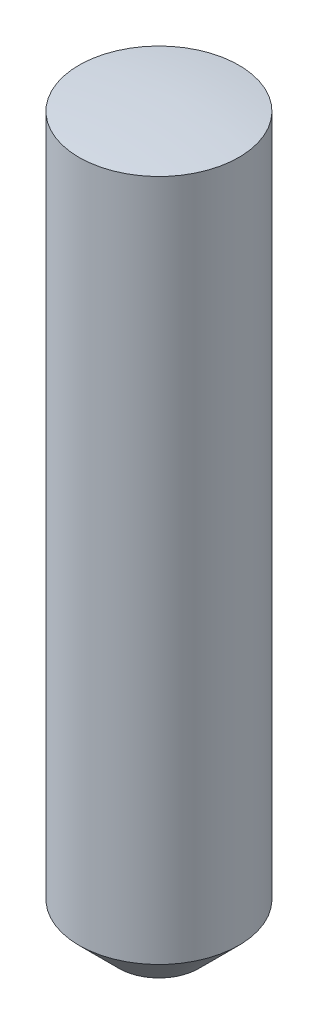
ISO-10303-21;
HEADER;
FILE_DESCRIPTION(('STEP AP214'),'2;1');
FILE_NAME('part.step','',(''),(''),'','','');
FILE_SCHEMA(('AUTOMOTIVE_DESIGN { 1 0 10303 214 1 1 1 1 }'));
ENDSEC;
DATA;
#1=APPLICATION_CONTEXT('core data for automotive mechanical design processes');
#2=APPLICATION_PROTOCOL_DEFINITION('international standard','automotive_design',2000,#1);
#3=PRODUCT_CONTEXT('',#1,'mechanical');
#4=PRODUCT('Part','Part','',(#3));
#5=PRODUCT_RELATED_PRODUCT_CATEGORY('part','',(#4));
#6=PRODUCT_DEFINITION_FORMATION('','',#4);
#7=PRODUCT_DEFINITION_CONTEXT('part definition',#1,'design');
#8=PRODUCT_DEFINITION('design','',#6,#7);
#9=PRODUCT_DEFINITION_SHAPE('','',#8);
#10=(LENGTH_UNIT() NAMED_UNIT(*) SI_UNIT(.MILLI.,.METRE.));
#11=(NAMED_UNIT(*) PLANE_ANGLE_UNIT() SI_UNIT($,.RADIAN.));
#12=(NAMED_UNIT(*) SI_UNIT($,.STERADIAN.) SOLID_ANGLE_UNIT());
#13=UNCERTAINTY_MEASURE_WITH_UNIT(LENGTH_MEASURE(1.E-05),#10,'distance_accuracy_value','');
#14=(GEOMETRIC_REPRESENTATION_CONTEXT(3) GLOBAL_UNCERTAINTY_ASSIGNED_CONTEXT((#13)) GLOBAL_UNIT_ASSIGNED_CONTEXT((#10,
#11,#12)) REPRESENTATION_CONTEXT('',''));
#15=CARTESIAN_POINT('',(0.,0.,0.));
#16=DIRECTION('',(0.,0.,1.));
#17=DIRECTION('',(1.,0.,0.));
#18=AXIS2_PLACEMENT_3D('',#15,#16,#17);
#19=CARTESIAN_POINT('',(0.,-9.1,0.));
#20=DIRECTION('',(0.,1.,0.));
#21=DIRECTION('',(0.,0.,1.));
#22=AXIS2_PLACEMENT_3D('',#19,#20,#21);
#23=PLANE('',#22);
#24=CARTESIAN_POINT('',(0.,-9.09999999993261,0.));
#25=DIRECTION('',(0.,1.,0.));
#26=DIRECTION('',(0.,0.,1.));
#27=AXIS2_PLACEMENT_3D('',#24,#25,#26);
#28=CIRCLE('',#27,0.499999999988177);
#29=CARTESIAN_POINT('',(0.,-9.09999999993261,0.499999999988177));
#30=VERTEX_POINT('',#29);
#31=EDGE_CURVE('E18',#30,#30,#28,.T.);
#32=ORIENTED_EDGE('',*,*,#31,.F.);
#33=EDGE_LOOP('',(#32));
#34=FACE_BOUND('',#33,.T.);
#35=ADVANCED_FACE('F15',(#34),#23,.F.);
#36=CARTESIAN_POINT('',(0.,-8.60000000000127,0.));
#37=DIRECTION('',(0.,1.,0.));
#38=DIRECTION('',(0.,0.,1.));
#39=AXIS2_PLACEMENT_3D('',#36,#37,#38);
#40=CONICAL_SURFACE('',#39,0.99999999991951,0.785398163397448);
#41=CARTESIAN_POINT('',(0.,-8.6,0.));
#42=DIRECTION('',(0.,1.,0.));
#43=DIRECTION('',(0.,0.,1.));
#44=AXIS2_PLACEMENT_3D('',#41,#42,#43);
#45=CIRCLE('',#44,1.);
#46=CARTESIAN_POINT('',(0.,-8.6,1.));
#47=VERTEX_POINT('',#46);
#48=EDGE_CURVE('E22',#47,#47,#45,.T.);
#49=ORIENTED_EDGE('',*,*,#48,.F.);
#50=EDGE_LOOP('',(#49));
#51=FACE_BOUND('',#50,.T.);
#52=ORIENTED_EDGE('',*,*,#31,.T.);
#53=EDGE_LOOP('',(#52));
#54=FACE_BOUND('',#53,.T.);
#55=ADVANCED_FACE('F34',(#51,#54),#40,.T.);
#56=CARTESIAN_POINT('',(0.,-8.,0.));
#57=DIRECTION('',(-1.,0.,0.));
#58=DIRECTION('',(0.,1.,0.));
#59=AXIS2_PLACEMENT_3D('',#56,#57,#58);
#60=SPHERICAL_SURFACE('',#59,8.);
#61=CARTESIAN_POINT('',(0.,-0.0627460668062279,0.));
#62=DIRECTION('',(0.,1.,0.));
#63=DIRECTION('',(0.,0.,1.));
#64=AXIS2_PLACEMENT_3D('',#61,#62,#63);
#65=CIRCLE('',#64,1.);
#66=CARTESIAN_POINT('',(0.,-0.0627460668062279,1.));
#67=VERTEX_POINT('',#66);
#68=EDGE_CURVE('E10',#67,#67,#65,.F.);
#69=ORIENTED_EDGE('',*,*,#68,.F.);
#70=EDGE_LOOP('',(#69));
#71=FACE_BOUND('',#70,.T.);
#72=ADVANCED_FACE('F30',(#71),#60,.T.);
#73=CARTESIAN_POINT('',(0.,-9.1,0.));
#74=DIRECTION('',(0.,1.,0.));
#75=DIRECTION('',(0.,0.,1.));
#76=AXIS2_PLACEMENT_3D('',#73,#74,#75);
#77=CYLINDRICAL_SURFACE('',#76,1.);
#78=ORIENTED_EDGE('',*,*,#68,.T.);
#79=EDGE_LOOP('',(#78));
#80=FACE_BOUND('',#79,.T.);
#81=ORIENTED_EDGE('',*,*,#48,.T.);
#82=EDGE_LOOP('',(#81));
#83=FACE_BOUND('',#82,.T.);
#84=ADVANCED_FACE('F33',(#80,#83),#77,.T.);
#85=CLOSED_SHELL('',(#35,#55,#72,#84));
#86=MANIFOLD_SOLID_BREP('B1',#85);
#87=ADVANCED_BREP_SHAPE_REPRESENTATION('',(#18,#86),#14);
#88=SHAPE_DEFINITION_REPRESENTATION(#9,#87);
ENDSEC;
END-ISO-10303-21;
